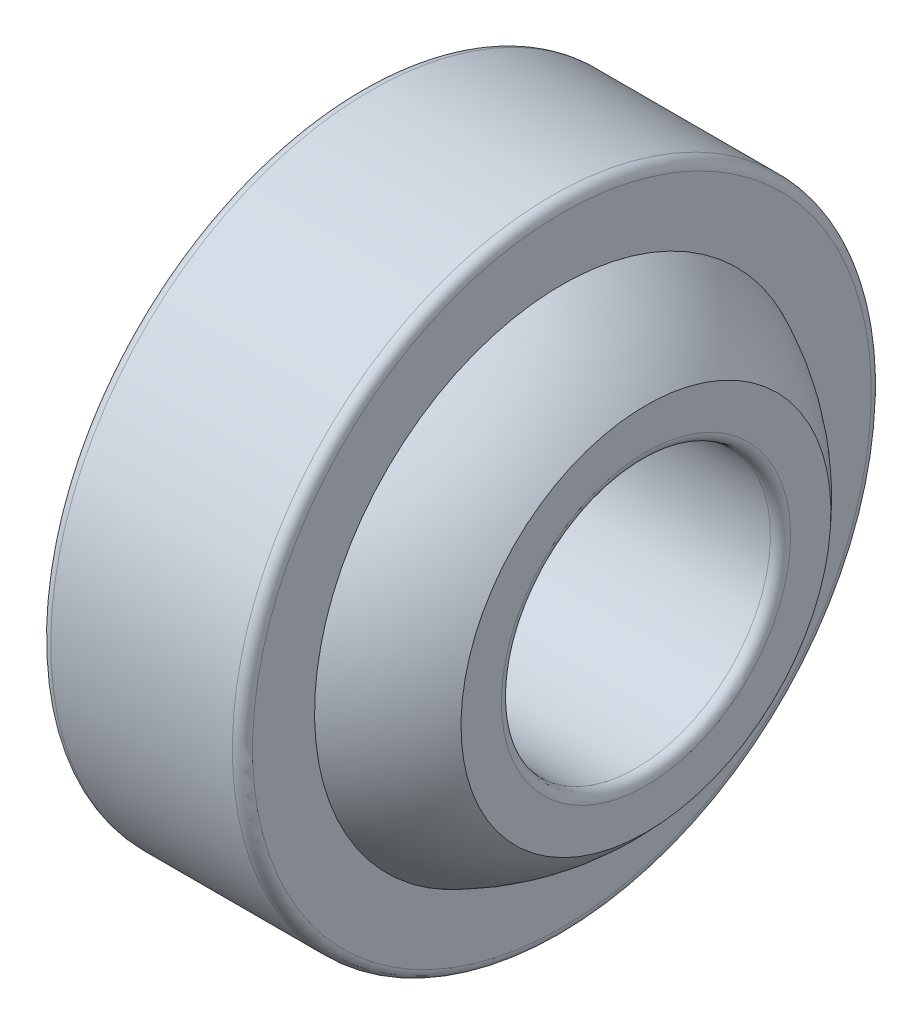
ISO-10303-21;
HEADER;
FILE_DESCRIPTION(('STEP AP214'),'2;1');
FILE_NAME('part.step','',(''),(''),'','','');
FILE_SCHEMA(('AUTOMOTIVE_DESIGN { 1 0 10303 214 1 1 1 1 }'));
ENDSEC;
DATA;
#1=APPLICATION_CONTEXT('core data for automotive mechanical design processes');
#2=APPLICATION_PROTOCOL_DEFINITION('international standard','automotive_design',2000,#1);
#3=PRODUCT_CONTEXT('',#1,'mechanical');
#4=PRODUCT('Part','Part','',(#3));
#5=PRODUCT_RELATED_PRODUCT_CATEGORY('part','',(#4));
#6=PRODUCT_DEFINITION_FORMATION('','',#4);
#7=PRODUCT_DEFINITION_CONTEXT('part definition',#1,'design');
#8=PRODUCT_DEFINITION('design','',#6,#7);
#9=PRODUCT_DEFINITION_SHAPE('','',#8);
#10=(LENGTH_UNIT() NAMED_UNIT(*) SI_UNIT(.MILLI.,.METRE.));
#11=(NAMED_UNIT(*) PLANE_ANGLE_UNIT() SI_UNIT($,.RADIAN.));
#12=(NAMED_UNIT(*) SI_UNIT($,.STERADIAN.) SOLID_ANGLE_UNIT());
#13=UNCERTAINTY_MEASURE_WITH_UNIT(LENGTH_MEASURE(1.E-05),#10,'distance_accuracy_value','');
#14=(GEOMETRIC_REPRESENTATION_CONTEXT(3) GLOBAL_UNCERTAINTY_ASSIGNED_CONTEXT((#13)) GLOBAL_UNIT_ASSIGNED_CONTEXT((#10,
#11,#12)) REPRESENTATION_CONTEXT('',''));
#15=CARTESIAN_POINT('',(0.,0.,0.));
#16=DIRECTION('',(0.,0.,1.));
#17=DIRECTION('',(1.,0.,0.));
#18=AXIS2_PLACEMENT_3D('',#15,#16,#17);
#19=CARTESIAN_POINT('',(0.,0.,0.));
#20=DIRECTION('',(-1.,0.,0.));
#21=DIRECTION('',(0.,-1.,0.));
#22=AXIS2_PLACEMENT_3D('',#19,#20,#21);
#23=DEGENERATE_TOROIDAL_SURFACE('',#22,0.699999999999997,7.3,.T.);
#24=CARTESIAN_POINT('',(-5.5,0.,0.));
#25=DIRECTION('',(-1.,0.,0.));
#26=DIRECTION('',(0.,-1.,0.));
#27=AXIS2_PLACEMENT_3D('',#24,#25,#26);
#28=CIRCLE('',#27,5.5);
#29=CARTESIAN_POINT('',(-5.5,-5.5,0.));
#30=VERTEX_POINT('',#29);
#31=EDGE_CURVE('E11',#30,#30,#28,.T.);
#32=ORIENTED_EDGE('',*,*,#31,.F.);
#33=EDGE_LOOP('',(#32));
#34=FACE_BOUND('',#33,.T.);
#35=CARTESIAN_POINT('',(5.5,0.,0.));
#36=DIRECTION('',(-1.,0.,0.));
#37=DIRECTION('',(0.,-1.,0.));
#38=AXIS2_PLACEMENT_3D('',#35,#36,#37);
#39=CIRCLE('',#38,5.5);
#40=CARTESIAN_POINT('',(5.5,-5.5,0.));
#41=VERTEX_POINT('',#40);
#42=EDGE_CURVE('E63',#41,#41,#39,.T.);
#43=ORIENTED_EDGE('',*,*,#42,.T.);
#44=EDGE_LOOP('',(#43));
#45=FACE_BOUND('',#44,.T.);
#46=ADVANCED_FACE('F41',(#34,#45),#23,.T.);
#47=CARTESIAN_POINT('',(-5.5,5.5,0.));
#48=DIRECTION('',(1.,0.,0.));
#49=DIRECTION('',(0.,1.,0.));
#50=AXIS2_PLACEMENT_3D('',#47,#48,#49);
#51=PLANE('',#50);
#52=CARTESIAN_POINT('',(-5.5,0.,0.));
#53=DIRECTION('',(-1.,0.,0.));
#54=DIRECTION('',(0.,-1.,0.));
#55=AXIS2_PLACEMENT_3D('',#52,#53,#54);
#56=CIRCLE('',#55,4.3);
#57=CARTESIAN_POINT('',(-5.5,-4.3,0.));
#58=VERTEX_POINT('',#57);
#59=EDGE_CURVE('E47',#58,#58,#56,.T.);
#60=ORIENTED_EDGE('',*,*,#59,.F.);
#61=EDGE_LOOP('',(#60));
#62=FACE_BOUND('',#61,.T.);
#63=ORIENTED_EDGE('',*,*,#31,.T.);
#64=EDGE_LOOP('',(#63));
#65=FACE_BOUND('',#64,.T.);
#66=ADVANCED_FACE('F88',(#62,#65),#51,.F.);
#67=CARTESIAN_POINT('',(-5.2,0.,0.));
#68=DIRECTION('',(-1.,0.,0.));
#69=DIRECTION('',(0.,-1.,0.));
#70=AXIS2_PLACEMENT_3D('',#67,#68,#69);
#71=TOROIDAL_SURFACE('',#70,4.3,0.3);
#72=CARTESIAN_POINT('',(-5.2,0.,0.));
#73=DIRECTION('',(-1.,0.,0.));
#74=DIRECTION('',(0.,-1.,0.));
#75=AXIS2_PLACEMENT_3D('',#72,#73,#74);
#76=CIRCLE('',#75,4.);
#77=CARTESIAN_POINT('',(-5.2,-4.,0.));
#78=VERTEX_POINT('',#77);
#79=EDGE_CURVE('E51',#78,#78,#76,.T.);
#80=ORIENTED_EDGE('',*,*,#79,.F.);
#81=EDGE_LOOP('',(#80));
#82=FACE_BOUND('',#81,.T.);
#83=ORIENTED_EDGE('',*,*,#59,.T.);
#84=EDGE_LOOP('',(#83));
#85=FACE_BOUND('',#84,.T.);
#86=ADVANCED_FACE('F83',(#82,#85),#71,.T.);
#87=CARTESIAN_POINT('',(-7.,0.,0.));
#88=DIRECTION('',(-1.,0.,0.));
#89=DIRECTION('',(0.,-1.,0.));
#90=AXIS2_PLACEMENT_3D('',#87,#88,#89);
#91=CYLINDRICAL_SURFACE('',#90,4.);
#92=CARTESIAN_POINT('',(5.2,0.,0.));
#93=DIRECTION('',(-1.,0.,0.));
#94=DIRECTION('',(0.,-1.,0.));
#95=AXIS2_PLACEMENT_3D('',#92,#93,#94);
#96=CIRCLE('',#95,4.);
#97=CARTESIAN_POINT('',(5.2,-4.,0.));
#98=VERTEX_POINT('',#97);
#99=EDGE_CURVE('E55',#98,#98,#96,.T.);
#100=ORIENTED_EDGE('',*,*,#99,.F.);
#101=EDGE_LOOP('',(#100));
#102=FACE_BOUND('',#101,.T.);
#103=ORIENTED_EDGE('',*,*,#79,.T.);
#104=EDGE_LOOP('',(#103));
#105=FACE_BOUND('',#104,.T.);
#106=ADVANCED_FACE('F77',(#102,#105),#91,.F.);
#107=CARTESIAN_POINT('',(5.2,0.,0.));
#108=DIRECTION('',(-1.,0.,0.));
#109=DIRECTION('',(0.,-1.,0.));
#110=AXIS2_PLACEMENT_3D('',#107,#108,#109);
#111=TOROIDAL_SURFACE('',#110,4.3,0.299999999999999);
#112=CARTESIAN_POINT('',(5.5,0.,0.));
#113=DIRECTION('',(-1.,0.,0.));
#114=DIRECTION('',(0.,-1.,0.));
#115=AXIS2_PLACEMENT_3D('',#112,#113,#114);
#116=CIRCLE('',#115,4.3);
#117=CARTESIAN_POINT('',(5.5,-4.3,0.));
#118=VERTEX_POINT('',#117);
#119=EDGE_CURVE('E60',#118,#118,#116,.T.);
#120=ORIENTED_EDGE('',*,*,#119,.F.);
#121=EDGE_LOOP('',(#120));
#122=FACE_BOUND('',#121,.T.);
#123=ORIENTED_EDGE('',*,*,#99,.T.);
#124=EDGE_LOOP('',(#123));
#125=FACE_BOUND('',#124,.T.);
#126=ADVANCED_FACE('F71',(#122,#125),#111,.T.);
#127=CARTESIAN_POINT('',(5.5,5.5,0.));
#128=DIRECTION('',(-1.,0.,0.));
#129=DIRECTION('',(0.,-1.,0.));
#130=AXIS2_PLACEMENT_3D('',#127,#128,#129);
#131=PLANE('',#130);
#132=ORIENTED_EDGE('',*,*,#42,.F.);
#133=EDGE_LOOP('',(#132));
#134=FACE_BOUND('',#133,.T.);
#135=ORIENTED_EDGE('',*,*,#119,.T.);
#136=EDGE_LOOP('',(#135));
#137=FACE_BOUND('',#136,.T.);
#138=ADVANCED_FACE('F68',(#134,#137),#131,.F.);
#139=CLOSED_SHELL('',(#46,#66,#86,#106,#126,#138));
#140=MANIFOLD_SOLID_BREP('B2',#139);
#141=CARTESIAN_POINT('',(0.,0.,0.));
#142=DIRECTION('',(-1.,0.,0.));
#143=DIRECTION('',(0.,-1.,0.));
#144=AXIS2_PLACEMENT_3D('',#141,#142,#143);
#145=DEGENERATE_TOROIDAL_SURFACE('',#144,0.699999999999997,7.3,.T.);
#146=CARTESIAN_POINT('',(3.,0.,0.));
#147=DIRECTION('',(-1.,0.,0.));
#148=DIRECTION('',(0.,-1.,0.));
#149=AXIS2_PLACEMENT_3D('',#146,#147,#148);
#150=CIRCLE('',#149,7.35507325278993);
#151=CARTESIAN_POINT('',(3.,-7.35507325278993,0.));
#152=VERTEX_POINT('',#151);
#153=EDGE_CURVE('E40',#152,#152,#150,.T.);
#154=ORIENTED_EDGE('',*,*,#153,.F.);
#155=EDGE_LOOP('',(#154));
#156=FACE_BOUND('',#155,.T.);
#157=CARTESIAN_POINT('',(-3.,0.,0.));
#158=DIRECTION('',(-1.,0.,0.));
#159=DIRECTION('',(0.,-1.,0.));
#160=AXIS2_PLACEMENT_3D('',#157,#158,#159);
#161=CIRCLE('',#160,7.35507325278993);
#162=CARTESIAN_POINT('',(-3.,-7.35507325278993,0.));
#163=VERTEX_POINT('',#162);
#164=EDGE_CURVE('E155',#163,#163,#161,.T.);
#165=ORIENTED_EDGE('',*,*,#164,.T.);
#166=EDGE_LOOP('',(#165));
#167=FACE_BOUND('',#166,.T.);
#168=ADVANCED_FACE('F133',(#156,#167),#145,.F.);
#169=CARTESIAN_POINT('',(3.,9.2,0.));
#170=DIRECTION('',(-1.,0.,0.));
#171=DIRECTION('',(0.,-1.,0.));
#172=AXIS2_PLACEMENT_3D('',#169,#170,#171);
#173=PLANE('',#172);
#174=CARTESIAN_POINT('',(3.,0.,0.));
#175=DIRECTION('',(-1.,0.,0.));
#176=DIRECTION('',(0.,-1.,0.));
#177=AXIS2_PLACEMENT_3D('',#174,#175,#176);
#178=CIRCLE('',#177,9.2);
#179=CARTESIAN_POINT('',(3.,-9.2,0.));
#180=VERTEX_POINT('',#179);
#181=EDGE_CURVE('E139',#180,#180,#178,.T.);
#182=ORIENTED_EDGE('',*,*,#181,.F.);
#183=EDGE_LOOP('',(#182));
#184=FACE_BOUND('',#183,.T.);
#185=ORIENTED_EDGE('',*,*,#153,.T.);
#186=EDGE_LOOP('',(#185));
#187=FACE_BOUND('',#186,.T.);
#188=ADVANCED_FACE('F180',(#184,#187),#173,.F.);
#189=CARTESIAN_POINT('',(2.7,0.,0.));
#190=DIRECTION('',(-1.,0.,0.));
#191=DIRECTION('',(0.,-1.,0.));
#192=AXIS2_PLACEMENT_3D('',#189,#190,#191);
#193=TOROIDAL_SURFACE('',#192,9.2,0.3);
#194=CARTESIAN_POINT('',(2.7,0.,0.));
#195=DIRECTION('',(-1.,0.,0.));
#196=DIRECTION('',(0.,-1.,0.));
#197=AXIS2_PLACEMENT_3D('',#194,#195,#196);
#198=CIRCLE('',#197,9.5);
#199=CARTESIAN_POINT('',(2.70000000000001,-9.5,0.));
#200=VERTEX_POINT('',#199);
#201=EDGE_CURVE('E143',#200,#200,#198,.T.);
#202=ORIENTED_EDGE('',*,*,#201,.F.);
#203=EDGE_LOOP('',(#202));
#204=FACE_BOUND('',#203,.T.);
#205=ORIENTED_EDGE('',*,*,#181,.T.);
#206=EDGE_LOOP('',(#205));
#207=FACE_BOUND('',#206,.T.);
#208=ADVANCED_FACE('F175',(#204,#207),#193,.T.);
#209=CARTESIAN_POINT('',(-7.,0.,0.));
#210=DIRECTION('',(-1.,0.,0.));
#211=DIRECTION('',(0.,-1.,0.));
#212=AXIS2_PLACEMENT_3D('',#209,#210,#211);
#213=CYLINDRICAL_SURFACE('',#212,9.5);
#214=CARTESIAN_POINT('',(-2.7,0.,0.));
#215=DIRECTION('',(-1.,0.,0.));
#216=DIRECTION('',(0.,-1.,0.));
#217=AXIS2_PLACEMENT_3D('',#214,#215,#216);
#218=CIRCLE('',#217,9.5);
#219=CARTESIAN_POINT('',(-2.7,-9.5,0.));
#220=VERTEX_POINT('',#219);
#221=EDGE_CURVE('E147',#220,#220,#218,.T.);
#222=ORIENTED_EDGE('',*,*,#221,.F.);
#223=EDGE_LOOP('',(#222));
#224=FACE_BOUND('',#223,.T.);
#225=ORIENTED_EDGE('',*,*,#201,.T.);
#226=EDGE_LOOP('',(#225));
#227=FACE_BOUND('',#226,.T.);
#228=ADVANCED_FACE('F169',(#224,#227),#213,.T.);
#229=CARTESIAN_POINT('',(-2.7,0.,0.));
#230=DIRECTION('',(-1.,0.,0.));
#231=DIRECTION('',(0.,-1.,0.));
#232=AXIS2_PLACEMENT_3D('',#229,#230,#231);
#233=TOROIDAL_SURFACE('',#232,9.2,0.3);
#234=CARTESIAN_POINT('',(-3.,0.,0.));
#235=DIRECTION('',(-1.,0.,0.));
#236=DIRECTION('',(0.,-1.,0.));
#237=AXIS2_PLACEMENT_3D('',#234,#235,#236);
#238=CIRCLE('',#237,9.2);
#239=CARTESIAN_POINT('',(-3.,-9.2,0.));
#240=VERTEX_POINT('',#239);
#241=EDGE_CURVE('E152',#240,#240,#238,.T.);
#242=ORIENTED_EDGE('',*,*,#241,.F.);
#243=EDGE_LOOP('',(#242));
#244=FACE_BOUND('',#243,.T.);
#245=ORIENTED_EDGE('',*,*,#221,.T.);
#246=EDGE_LOOP('',(#245));
#247=FACE_BOUND('',#246,.T.);
#248=ADVANCED_FACE('F163',(#244,#247),#233,.T.);
#249=CARTESIAN_POINT('',(-3.,7.35507325278993,0.));
#250=DIRECTION('',(1.,0.,0.));
#251=DIRECTION('',(0.,1.,0.));
#252=AXIS2_PLACEMENT_3D('',#249,#250,#251);
#253=PLANE('',#252);
#254=ORIENTED_EDGE('',*,*,#164,.F.);
#255=EDGE_LOOP('',(#254));
#256=FACE_BOUND('',#255,.T.);
#257=ORIENTED_EDGE('',*,*,#241,.T.);
#258=EDGE_LOOP('',(#257));
#259=FACE_BOUND('',#258,.T.);
#260=ADVANCED_FACE('F160',(#256,#259),#253,.F.);
#261=CLOSED_SHELL('',(#168,#188,#208,#228,#248,#260));
#262=MANIFOLD_SOLID_BREP('B6',#261);
#263=ADVANCED_BREP_SHAPE_REPRESENTATION('',(#18,#140,#262),#14);
#264=SHAPE_DEFINITION_REPRESENTATION(#9,#263);
ENDSEC;
END-ISO-10303-21;
